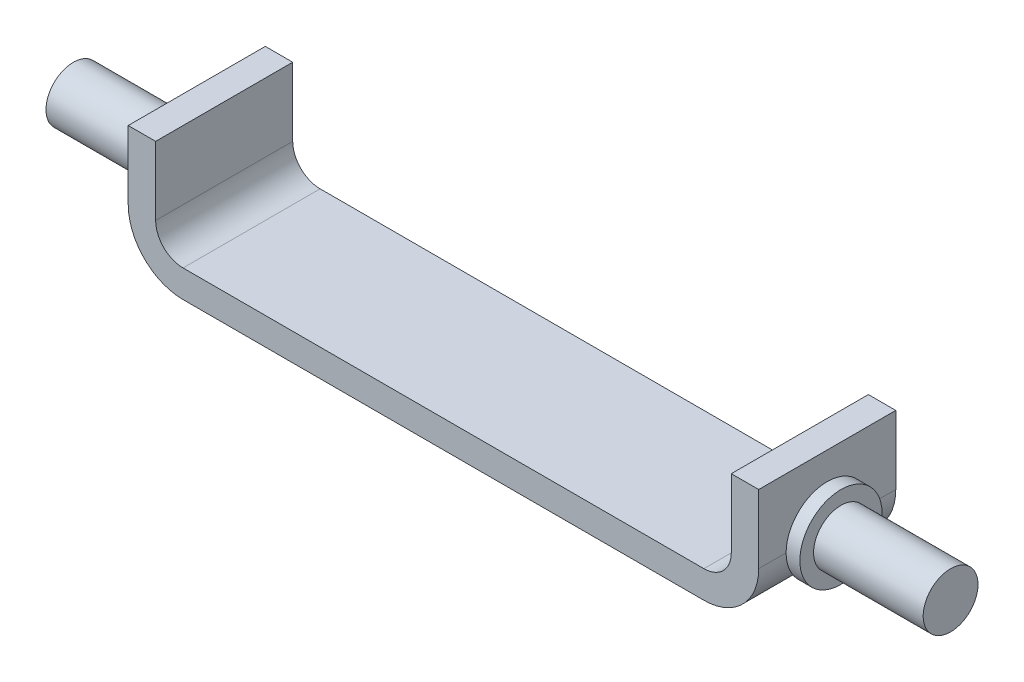
ISO-10303-21;
HEADER;
FILE_DESCRIPTION(('STEP AP214'),'2;1');
FILE_NAME('part.step','',(''),(''),'','','');
FILE_SCHEMA(('AUTOMOTIVE_DESIGN { 1 0 10303 214 1 1 1 1 }'));
ENDSEC;
DATA;
#1=APPLICATION_CONTEXT('core data for automotive mechanical design processes');
#2=APPLICATION_PROTOCOL_DEFINITION('international standard','automotive_design',2000,#1);
#3=PRODUCT_CONTEXT('',#1,'mechanical');
#4=PRODUCT('Part','Part','',(#3));
#5=PRODUCT_RELATED_PRODUCT_CATEGORY('part','',(#4));
#6=PRODUCT_DEFINITION_FORMATION('','',#4);
#7=PRODUCT_DEFINITION_CONTEXT('part definition',#1,'design');
#8=PRODUCT_DEFINITION('design','',#6,#7);
#9=PRODUCT_DEFINITION_SHAPE('','',#8);
#10=(LENGTH_UNIT() NAMED_UNIT(*) SI_UNIT(.MILLI.,.METRE.));
#11=(NAMED_UNIT(*) PLANE_ANGLE_UNIT() SI_UNIT($,.RADIAN.));
#12=(NAMED_UNIT(*) SI_UNIT($,.STERADIAN.) SOLID_ANGLE_UNIT());
#13=UNCERTAINTY_MEASURE_WITH_UNIT(LENGTH_MEASURE(1.E-05),#10,'distance_accuracy_value','');
#14=(GEOMETRIC_REPRESENTATION_CONTEXT(3) GLOBAL_UNCERTAINTY_ASSIGNED_CONTEXT((#13)) GLOBAL_UNIT_ASSIGNED_CONTEXT((#10,
#11,#12)) REPRESENTATION_CONTEXT('',''));
#15=CARTESIAN_POINT('',(0.,0.,0.));
#16=DIRECTION('',(0.,0.,1.));
#17=DIRECTION('',(1.,0.,0.));
#18=AXIS2_PLACEMENT_3D('',#15,#16,#17);
#19=CARTESIAN_POINT('',(113.582101442099,10.0000000000001,50.));
#20=DIRECTION('',(-1.,0.,0.));
#21=DIRECTION('',(0.,0.,1.));
#22=AXIS2_PLACEMENT_3D('',#19,#20,#21);
#23=PLANE('',#22);
#24=CARTESIAN_POINT('',(113.582101442099,10.,25.));
#25=DIRECTION('',(1.,0.,0.));
#26=DIRECTION('',(0.,0.,-1.));
#27=AXIS2_PLACEMENT_3D('',#24,#25,#26);
#28=CIRCLE('',#27,15.);
#29=CARTESIAN_POINT('',(113.582101442099,10.,10.));
#30=VERTEX_POINT('',#29);
#31=CARTESIAN_POINT('',(113.582101442099,10.,40.));
#32=VERTEX_POINT('',#31);
#33=EDGE_CURVE('E306',#30,#32,#28,.T.);
#34=ORIENTED_EDGE('',*,*,#33,.F.);
#35=DIRECTION('',(0.,0.,-1.));
#36=VECTOR('',#35,1.);
#37=CARTESIAN_POINT('',(113.582101442099,10.,50.));
#38=LINE('',#37,#36);
#39=CARTESIAN_POINT('',(113.582101442099,10.,0.));
#40=VERTEX_POINT('',#39);
#41=EDGE_CURVE('E205',#30,#40,#38,.T.);
#42=ORIENTED_EDGE('',*,*,#41,.T.);
#43=DIRECTION('',(0.,1.,0.));
#44=VECTOR('',#43,1.);
#45=CARTESIAN_POINT('',(113.582101442099,10.0000000000001,0.));
#46=LINE('',#45,#44);
#47=CARTESIAN_POINT('',(113.582101442099,35.,0.));
#48=VERTEX_POINT('',#47);
#49=EDGE_CURVE('E162',#40,#48,#46,.T.);
#50=ORIENTED_EDGE('',*,*,#49,.T.);
#51=DIRECTION('',(0.,0.,-1.));
#52=VECTOR('',#51,1.);
#53=CARTESIAN_POINT('',(113.582101442099,35.,50.));
#54=LINE('',#53,#52);
#55=CARTESIAN_POINT('',(113.582101442099,35.,50.));
#56=VERTEX_POINT('',#55);
#57=EDGE_CURVE('E11',#56,#48,#54,.T.);
#58=ORIENTED_EDGE('',*,*,#57,.F.);
#59=DIRECTION('',(0.,1.,0.));
#60=VECTOR('',#59,1.);
#61=CARTESIAN_POINT('',(113.582101442099,10.0000000000001,50.));
#62=LINE('',#61,#60);
#63=CARTESIAN_POINT('',(113.582101442099,10.,50.));
#64=VERTEX_POINT('',#63);
#65=EDGE_CURVE('E147',#64,#56,#62,.T.);
#66=ORIENTED_EDGE('',*,*,#65,.F.);
#67=EDGE_CURVE('E249',#64,#32,#38,.T.);
#68=ORIENTED_EDGE('',*,*,#67,.T.);
#69=EDGE_LOOP('',(#34,#42,#50,#58,#66,#68));
#70=FACE_BOUND('',#69,.T.);
#71=ADVANCED_FACE('F45',(#70),#23,.F.);
#72=CARTESIAN_POINT('',(103.582101442099,35.,50.));
#73=DIRECTION('',(0.,1.,0.));
#74=DIRECTION('',(0.,0.,1.));
#75=AXIS2_PLACEMENT_3D('',#72,#73,#74);
#76=PLANE('',#75);
#77=DIRECTION('',(1.,0.,0.));
#78=VECTOR('',#77,1.);
#79=CARTESIAN_POINT('',(103.582101442099,35.,0.));
#80=LINE('',#79,#78);
#81=CARTESIAN_POINT('',(103.582101442099,35.,0.));
#82=VERTEX_POINT('',#81);
#83=EDGE_CURVE('E208',#82,#48,#80,.T.);
#84=ORIENTED_EDGE('',*,*,#83,.F.);
#85=DIRECTION('',(0.,0.,-1.));
#86=VECTOR('',#85,1.);
#87=CARTESIAN_POINT('',(103.582101442099,35.,50.));
#88=LINE('',#87,#86);
#89=CARTESIAN_POINT('',(103.582101442099,35.,50.));
#90=VERTEX_POINT('',#89);
#91=EDGE_CURVE('E54',#90,#82,#88,.T.);
#92=ORIENTED_EDGE('',*,*,#91,.F.);
#93=DIRECTION('',(1.,0.,0.));
#94=VECTOR('',#93,1.);
#95=CARTESIAN_POINT('',(103.582101442099,35.,50.));
#96=LINE('',#95,#94);
#97=EDGE_CURVE('E152',#90,#56,#96,.T.);
#98=ORIENTED_EDGE('',*,*,#97,.T.);
#99=ORIENTED_EDGE('',*,*,#57,.T.);
#100=EDGE_LOOP('',(#84,#92,#98,#99));
#101=FACE_BOUND('',#100,.T.);
#102=ADVANCED_FACE('F166',(#101),#76,.T.);
#103=CARTESIAN_POINT('',(103.582101442099,10.0000000000001,50.));
#104=DIRECTION('',(-1.,0.,0.));
#105=DIRECTION('',(0.,0.,1.));
#106=AXIS2_PLACEMENT_3D('',#103,#104,#105);
#107=PLANE('',#106);
#108=DIRECTION('',(0.,1.,0.));
#109=VECTOR('',#108,1.);
#110=CARTESIAN_POINT('',(103.582101442099,10.0000000000001,0.));
#111=LINE('',#110,#109);
#112=CARTESIAN_POINT('',(103.582101442099,10.,0.));
#113=VERTEX_POINT('',#112);
#114=EDGE_CURVE('E212',#113,#82,#111,.T.);
#115=ORIENTED_EDGE('',*,*,#114,.F.);
#116=DIRECTION('',(0.,0.,-1.));
#117=VECTOR('',#116,1.);
#118=CARTESIAN_POINT('',(103.582101442099,10.,50.));
#119=LINE('',#118,#117);
#120=CARTESIAN_POINT('',(103.582101442099,10.,50.));
#121=VERTEX_POINT('',#120);
#122=EDGE_CURVE('E281',#121,#113,#119,.T.);
#123=ORIENTED_EDGE('',*,*,#122,.F.);
#124=DIRECTION('',(0.,1.,0.));
#125=VECTOR('',#124,1.);
#126=CARTESIAN_POINT('',(103.582101442099,10.0000000000001,50.));
#127=LINE('',#126,#125);
#128=EDGE_CURVE('E168',#121,#90,#127,.T.);
#129=ORIENTED_EDGE('',*,*,#128,.T.);
#130=ORIENTED_EDGE('',*,*,#91,.T.);
#131=EDGE_LOOP('',(#115,#123,#129,#130));
#132=FACE_BOUND('',#131,.T.);
#133=ADVANCED_FACE('F330',(#132),#107,.T.);
#134=CARTESIAN_POINT('',(93.5821014420986,10.,50.));
#135=DIRECTION('',(0.,0.,-1.));
#136=DIRECTION('',(-1.,0.,0.));
#137=AXIS2_PLACEMENT_3D('',#134,#135,#136);
#138=CYLINDRICAL_SURFACE('',#137,10.);
#139=CARTESIAN_POINT('',(93.5821014420986,10.,0.));
#140=DIRECTION('',(0.,0.,1.));
#141=DIRECTION('',(1.,0.,0.));
#142=AXIS2_PLACEMENT_3D('',#139,#140,#141);
#143=CIRCLE('',#142,10.);
#144=CARTESIAN_POINT('',(93.5821014420985,0.,0.));
#145=VERTEX_POINT('',#144);
#146=EDGE_CURVE('E216',#145,#113,#143,.T.);
#147=ORIENTED_EDGE('',*,*,#146,.F.);
#148=DIRECTION('',(0.,0.,-1.));
#149=VECTOR('',#148,1.);
#150=CARTESIAN_POINT('',(93.5821014420985,0.,50.));
#151=LINE('',#150,#149);
#152=CARTESIAN_POINT('',(93.5821014420985,0.,50.));
#153=VERTEX_POINT('',#152);
#154=EDGE_CURVE('E278',#153,#145,#151,.T.);
#155=ORIENTED_EDGE('',*,*,#154,.F.);
#156=CARTESIAN_POINT('',(93.5821014420986,10.,50.));
#157=DIRECTION('',(0.,0.,1.));
#158=DIRECTION('',(1.,0.,0.));
#159=AXIS2_PLACEMENT_3D('',#156,#157,#158);
#160=CIRCLE('',#159,10.);
#161=EDGE_CURVE('E171',#153,#121,#160,.T.);
#162=ORIENTED_EDGE('',*,*,#161,.T.);
#163=ORIENTED_EDGE('',*,*,#122,.T.);
#164=EDGE_LOOP('',(#147,#155,#162,#163));
#165=FACE_BOUND('',#164,.T.);
#166=ADVANCED_FACE('F334',(#165),#138,.F.);
#167=CARTESIAN_POINT('',(-96.4178985579013,0.,50.));
#168=DIRECTION('',(0.,1.,0.));
#169=DIRECTION('',(0.,0.,1.));
#170=AXIS2_PLACEMENT_3D('',#167,#168,#169);
#171=PLANE('',#170);
#172=DIRECTION('',(1.,0.,0.));
#173=VECTOR('',#172,1.);
#174=CARTESIAN_POINT('',(-96.4178985579013,0.,0.));
#175=LINE('',#174,#173);
#176=CARTESIAN_POINT('',(-96.4178985579013,0.,0.));
#177=VERTEX_POINT('',#176);
#178=EDGE_CURVE('E220',#177,#145,#175,.T.);
#179=ORIENTED_EDGE('',*,*,#178,.F.);
#180=DIRECTION('',(0.,0.,-1.));
#181=VECTOR('',#180,1.);
#182=CARTESIAN_POINT('',(-96.4178985579013,0.,50.));
#183=LINE('',#182,#181);
#184=CARTESIAN_POINT('',(-96.4178985579013,0.,50.));
#185=VERTEX_POINT('',#184);
#186=EDGE_CURVE('E275',#185,#177,#183,.T.);
#187=ORIENTED_EDGE('',*,*,#186,.F.);
#188=DIRECTION('',(1.,0.,0.));
#189=VECTOR('',#188,1.);
#190=CARTESIAN_POINT('',(-96.4178985579013,0.,50.));
#191=LINE('',#190,#189);
#192=EDGE_CURVE('E178',#185,#153,#191,.T.);
#193=ORIENTED_EDGE('',*,*,#192,.T.);
#194=ORIENTED_EDGE('',*,*,#154,.T.);
#195=EDGE_LOOP('',(#179,#187,#193,#194));
#196=FACE_BOUND('',#195,.T.);
#197=ADVANCED_FACE('F340',(#196),#171,.T.);
#198=CARTESIAN_POINT('',(-96.4178985579014,10.,50.));
#199=DIRECTION('',(0.,0.,-1.));
#200=DIRECTION('',(-1.,0.,0.));
#201=AXIS2_PLACEMENT_3D('',#198,#199,#200);
#202=CYLINDRICAL_SURFACE('',#201,10.);
#203=CARTESIAN_POINT('',(-96.4178985579014,10.,0.));
#204=DIRECTION('',(0.,0.,1.));
#205=DIRECTION('',(-1.,0.,0.));
#206=AXIS2_PLACEMENT_3D('',#203,#204,#205);
#207=CIRCLE('',#206,10.);
#208=CARTESIAN_POINT('',(-106.417898557901,10.0000000000001,0.));
#209=VERTEX_POINT('',#208);
#210=EDGE_CURVE('E224',#209,#177,#207,.T.);
#211=ORIENTED_EDGE('',*,*,#210,.F.);
#212=DIRECTION('',(0.,0.,-1.));
#213=VECTOR('',#212,1.);
#214=CARTESIAN_POINT('',(-106.417898557901,10.0000000000001,50.));
#215=LINE('',#214,#213);
#216=CARTESIAN_POINT('',(-106.417898557901,10.0000000000001,50.));
#217=VERTEX_POINT('',#216);
#218=EDGE_CURVE('E272',#217,#209,#215,.T.);
#219=ORIENTED_EDGE('',*,*,#218,.F.);
#220=CARTESIAN_POINT('',(-96.4178985579014,10.,50.));
#221=DIRECTION('',(0.,0.,1.));
#222=DIRECTION('',(-1.,0.,0.));
#223=AXIS2_PLACEMENT_3D('',#220,#221,#222);
#224=CIRCLE('',#223,10.);
#225=EDGE_CURVE('E182',#217,#185,#224,.T.);
#226=ORIENTED_EDGE('',*,*,#225,.T.);
#227=ORIENTED_EDGE('',*,*,#186,.T.);
#228=EDGE_LOOP('',(#211,#219,#226,#227));
#229=FACE_BOUND('',#228,.T.);
#230=ADVANCED_FACE('F344',(#229),#202,.F.);
#231=CARTESIAN_POINT('',(-106.417898557901,10.0000000000001,50.));
#232=DIRECTION('',(1.,0.,0.));
#233=DIRECTION('',(0.,0.,-1.));
#234=AXIS2_PLACEMENT_3D('',#231,#232,#233);
#235=PLANE('',#234);
#236=DIRECTION('',(0.,-1.,0.));
#237=VECTOR('',#236,1.);
#238=CARTESIAN_POINT('',(-106.417898557901,10.0000000000001,0.));
#239=LINE('',#238,#237);
#240=CARTESIAN_POINT('',(-106.417898557901,35.,0.));
#241=VERTEX_POINT('',#240);
#242=EDGE_CURVE('E228',#241,#209,#239,.T.);
#243=ORIENTED_EDGE('',*,*,#242,.F.);
#244=DIRECTION('',(0.,0.,-1.));
#245=VECTOR('',#244,1.);
#246=CARTESIAN_POINT('',(-106.417898557901,35.,50.));
#247=LINE('',#246,#245);
#248=CARTESIAN_POINT('',(-106.417898557901,35.,50.));
#249=VERTEX_POINT('',#248);
#250=EDGE_CURVE('E269',#249,#241,#247,.T.);
#251=ORIENTED_EDGE('',*,*,#250,.F.);
#252=DIRECTION('',(0.,-1.,0.));
#253=VECTOR('',#252,1.);
#254=CARTESIAN_POINT('',(-106.417898557901,10.0000000000001,50.));
#255=LINE('',#254,#253);
#256=EDGE_CURVE('E186',#249,#217,#255,.T.);
#257=ORIENTED_EDGE('',*,*,#256,.T.);
#258=ORIENTED_EDGE('',*,*,#218,.T.);
#259=EDGE_LOOP('',(#243,#251,#257,#258));
#260=FACE_BOUND('',#259,.T.);
#261=ADVANCED_FACE('F348',(#260),#235,.T.);
#262=CARTESIAN_POINT('',(-116.417898557901,35.,50.));
#263=DIRECTION('',(0.,1.,0.));
#264=DIRECTION('',(0.,0.,1.));
#265=AXIS2_PLACEMENT_3D('',#262,#263,#264);
#266=PLANE('',#265);
#267=DIRECTION('',(1.,0.,0.));
#268=VECTOR('',#267,1.);
#269=CARTESIAN_POINT('',(-116.417898557901,35.,0.));
#270=LINE('',#269,#268);
#271=CARTESIAN_POINT('',(-116.417898557901,35.,0.));
#272=VERTEX_POINT('',#271);
#273=EDGE_CURVE('E232',#272,#241,#270,.T.);
#274=ORIENTED_EDGE('',*,*,#273,.F.);
#275=DIRECTION('',(0.,0.,-1.));
#276=VECTOR('',#275,1.);
#277=CARTESIAN_POINT('',(-116.417898557901,35.,50.));
#278=LINE('',#277,#276);
#279=CARTESIAN_POINT('',(-116.417898557901,35.,50.));
#280=VERTEX_POINT('',#279);
#281=EDGE_CURVE('E265',#280,#272,#278,.T.);
#282=ORIENTED_EDGE('',*,*,#281,.F.);
#283=DIRECTION('',(1.,0.,0.));
#284=VECTOR('',#283,1.);
#285=CARTESIAN_POINT('',(-116.417898557901,35.,50.));
#286=LINE('',#285,#284);
#287=EDGE_CURVE('E190',#280,#249,#286,.T.);
#288=ORIENTED_EDGE('',*,*,#287,.T.);
#289=ORIENTED_EDGE('',*,*,#250,.T.);
#290=EDGE_LOOP('',(#274,#282,#288,#289));
#291=FACE_BOUND('',#290,.T.);
#292=ADVANCED_FACE('F352',(#291),#266,.T.);
#293=CARTESIAN_POINT('',(-116.417898557901,10.0000000000001,50.));
#294=DIRECTION('',(1.,0.,0.));
#295=DIRECTION('',(0.,0.,-1.));
#296=AXIS2_PLACEMENT_3D('',#293,#294,#295);
#297=PLANE('',#296);
#298=CARTESIAN_POINT('',(-116.417898557901,10.0000000000001,25.));
#299=DIRECTION('',(-1.,0.,0.));
#300=DIRECTION('',(0.,0.,1.));
#301=AXIS2_PLACEMENT_3D('',#298,#299,#300);
#302=CIRCLE('',#301,15.);
#303=CARTESIAN_POINT('',(-116.417898557901,10.0000000000001,40.));
#304=VERTEX_POINT('',#303);
#305=CARTESIAN_POINT('',(-116.417898557901,10.0000000000001,10.));
#306=VERTEX_POINT('',#305);
#307=EDGE_CURVE('E297',#304,#306,#302,.T.);
#308=ORIENTED_EDGE('',*,*,#307,.F.);
#309=DIRECTION('',(0.,0.,-1.));
#310=VECTOR('',#309,1.);
#311=CARTESIAN_POINT('',(-116.417898557901,10.0000000000001,50.));
#312=LINE('',#311,#310);
#313=CARTESIAN_POINT('',(-116.417898557901,10.0000000000001,50.));
#314=VERTEX_POINT('',#313);
#315=EDGE_CURVE('E261',#314,#304,#312,.T.);
#316=ORIENTED_EDGE('',*,*,#315,.F.);
#317=DIRECTION('',(0.,1.,0.));
#318=VECTOR('',#317,1.);
#319=CARTESIAN_POINT('',(-116.417898557901,10.0000000000001,50.));
#320=LINE('',#319,#318);
#321=EDGE_CURVE('E194',#280,#314,#320,.F.);
#322=ORIENTED_EDGE('',*,*,#321,.F.);
#323=ORIENTED_EDGE('',*,*,#281,.T.);
#324=DIRECTION('',(0.,1.,0.));
#325=VECTOR('',#324,1.);
#326=CARTESIAN_POINT('',(-116.417898557901,10.0000000000001,0.));
#327=LINE('',#326,#325);
#328=CARTESIAN_POINT('',(-116.417898557901,10.0000000000001,0.));
#329=VERTEX_POINT('',#328);
#330=EDGE_CURVE('E236',#272,#329,#327,.F.);
#331=ORIENTED_EDGE('',*,*,#330,.T.);
#332=EDGE_CURVE('E260',#306,#329,#312,.T.);
#333=ORIENTED_EDGE('',*,*,#332,.F.);
#334=EDGE_LOOP('',(#308,#316,#322,#323,#331,#333));
#335=FACE_BOUND('',#334,.T.);
#336=ADVANCED_FACE('F356',(#335),#297,.F.);
#337=CARTESIAN_POINT('',(-96.4178985579014,10.,50.));
#338=DIRECTION('',(0.,0.,-1.));
#339=DIRECTION('',(-1.,0.,0.));
#340=AXIS2_PLACEMENT_3D('',#337,#338,#339);
#341=CYLINDRICAL_SURFACE('',#340,20.);
#342=CARTESIAN_POINT('',(-96.4178985579014,10.,0.));
#343=DIRECTION('',(0.,0.,1.));
#344=DIRECTION('',(1.,0.,0.));
#345=AXIS2_PLACEMENT_3D('',#342,#343,#344);
#346=CIRCLE('',#345,20.);
#347=CARTESIAN_POINT('',(-96.4178985579013,-10.,0.));
#348=VERTEX_POINT('',#347);
#349=EDGE_CURVE('E240',#329,#348,#346,.T.);
#350=ORIENTED_EDGE('',*,*,#349,.T.);
#351=DIRECTION('',(0.,0.,-1.));
#352=VECTOR('',#351,1.);
#353=CARTESIAN_POINT('',(-96.4178985579013,-10.,50.));
#354=LINE('',#353,#352);
#355=CARTESIAN_POINT('',(-96.4178985579013,-10.,50.));
#356=VERTEX_POINT('',#355);
#357=EDGE_CURVE('E256',#356,#348,#354,.T.);
#358=ORIENTED_EDGE('',*,*,#357,.F.);
#359=CARTESIAN_POINT('',(-96.4178985579014,10.,50.));
#360=DIRECTION('',(0.,0.,1.));
#361=DIRECTION('',(1.,0.,0.));
#362=AXIS2_PLACEMENT_3D('',#359,#360,#361);
#363=CIRCLE('',#362,20.);
#364=EDGE_CURVE('E197',#314,#356,#363,.T.);
#365=ORIENTED_EDGE('',*,*,#364,.F.);
#366=ORIENTED_EDGE('',*,*,#315,.T.);
#367=EDGE_CURVE('E266',#304,#306,#312,.T.);
#368=ORIENTED_EDGE('',*,*,#367,.T.);
#369=ORIENTED_EDGE('',*,*,#332,.T.);
#370=EDGE_LOOP('',(#350,#358,#365,#366,#368,#369));
#371=FACE_BOUND('',#370,.T.);
#372=ADVANCED_FACE('F360',(#371),#341,.T.);
#373=CARTESIAN_POINT('',(-96.4178985579013,-10.,50.));
#374=DIRECTION('',(0.,1.,0.));
#375=DIRECTION('',(0.,0.,1.));
#376=AXIS2_PLACEMENT_3D('',#373,#374,#375);
#377=PLANE('',#376);
#378=DIRECTION('',(1.,0.,0.));
#379=VECTOR('',#378,1.);
#380=CARTESIAN_POINT('',(-96.4178985579013,-10.,0.));
#381=LINE('',#380,#379);
#382=CARTESIAN_POINT('',(93.5821014420984,-10.,0.));
#383=VERTEX_POINT('',#382);
#384=EDGE_CURVE('E243',#348,#383,#381,.T.);
#385=ORIENTED_EDGE('',*,*,#384,.T.);
#386=DIRECTION('',(0.,0.,-1.));
#387=VECTOR('',#386,1.);
#388=CARTESIAN_POINT('',(93.5821014420984,-10.,50.));
#389=LINE('',#388,#387);
#390=CARTESIAN_POINT('',(93.5821014420984,-10.,50.));
#391=VERTEX_POINT('',#390);
#392=EDGE_CURVE('E252',#391,#383,#389,.T.);
#393=ORIENTED_EDGE('',*,*,#392,.F.);
#394=DIRECTION('',(1.,0.,0.));
#395=VECTOR('',#394,1.);
#396=CARTESIAN_POINT('',(-96.4178985579013,-10.,50.));
#397=LINE('',#396,#395);
#398=EDGE_CURVE('E200',#356,#391,#397,.T.);
#399=ORIENTED_EDGE('',*,*,#398,.F.);
#400=ORIENTED_EDGE('',*,*,#357,.T.);
#401=EDGE_LOOP('',(#385,#393,#399,#400));
#402=FACE_BOUND('',#401,.T.);
#403=ADVANCED_FACE('F364',(#402),#377,.F.);
#404=CARTESIAN_POINT('',(93.5821014420986,10.,50.));
#405=DIRECTION('',(0.,0.,-1.));
#406=DIRECTION('',(-1.,0.,0.));
#407=AXIS2_PLACEMENT_3D('',#404,#405,#406);
#408=CYLINDRICAL_SURFACE('',#407,20.);
#409=CARTESIAN_POINT('',(93.5821014420986,10.,0.));
#410=DIRECTION('',(0.,0.,1.));
#411=DIRECTION('',(1.,0.,0.));
#412=AXIS2_PLACEMENT_3D('',#409,#410,#411);
#413=CIRCLE('',#412,20.);
#414=EDGE_CURVE('E158',#383,#40,#413,.T.);
#415=ORIENTED_EDGE('',*,*,#414,.T.);
#416=ORIENTED_EDGE('',*,*,#41,.F.);
#417=EDGE_CURVE('E62',#32,#30,#38,.T.);
#418=ORIENTED_EDGE('',*,*,#417,.F.);
#419=ORIENTED_EDGE('',*,*,#67,.F.);
#420=CARTESIAN_POINT('',(93.5821014420986,10.,50.));
#421=DIRECTION('',(0.,0.,1.));
#422=DIRECTION('',(1.,0.,0.));
#423=AXIS2_PLACEMENT_3D('',#420,#421,#422);
#424=CIRCLE('',#423,20.);
#425=EDGE_CURVE('E155',#391,#64,#424,.T.);
#426=ORIENTED_EDGE('',*,*,#425,.F.);
#427=ORIENTED_EDGE('',*,*,#392,.T.);
#428=EDGE_LOOP('',(#415,#416,#418,#419,#426,#427));
#429=FACE_BOUND('',#428,.T.);
#430=ADVANCED_FACE('F368',(#429),#408,.T.);
#431=CARTESIAN_POINT('',(93.5821014420986,10.,50.));
#432=DIRECTION('',(0.,0.,1.));
#433=DIRECTION('',(1.,0.,0.));
#434=AXIS2_PLACEMENT_3D('',#431,#432,#433);
#435=PLANE('',#434);
#436=ORIENTED_EDGE('',*,*,#65,.T.);
#437=ORIENTED_EDGE('',*,*,#97,.F.);
#438=ORIENTED_EDGE('',*,*,#128,.F.);
#439=ORIENTED_EDGE('',*,*,#161,.F.);
#440=ORIENTED_EDGE('',*,*,#192,.F.);
#441=ORIENTED_EDGE('',*,*,#225,.F.);
#442=ORIENTED_EDGE('',*,*,#256,.F.);
#443=ORIENTED_EDGE('',*,*,#287,.F.);
#444=ORIENTED_EDGE('',*,*,#321,.T.);
#445=ORIENTED_EDGE('',*,*,#364,.T.);
#446=ORIENTED_EDGE('',*,*,#398,.T.);
#447=ORIENTED_EDGE('',*,*,#425,.T.);
#448=EDGE_LOOP('',(#436,#437,#438,#439,#440,#441,#442,#443,#444,#445,#446,#447));
#449=FACE_BOUND('',#448,.T.);
#450=ADVANCED_FACE('F149',(#449),#435,.T.);
#451=CARTESIAN_POINT('',(93.5821014420986,10.,0.));
#452=DIRECTION('',(0.,0.,1.));
#453=DIRECTION('',(1.,0.,0.));
#454=AXIS2_PLACEMENT_3D('',#451,#452,#453);
#455=PLANE('',#454);
#456=ORIENTED_EDGE('',*,*,#49,.F.);
#457=ORIENTED_EDGE('',*,*,#414,.F.);
#458=ORIENTED_EDGE('',*,*,#384,.F.);
#459=ORIENTED_EDGE('',*,*,#349,.F.);
#460=ORIENTED_EDGE('',*,*,#330,.F.);
#461=ORIENTED_EDGE('',*,*,#273,.T.);
#462=ORIENTED_EDGE('',*,*,#242,.T.);
#463=ORIENTED_EDGE('',*,*,#210,.T.);
#464=ORIENTED_EDGE('',*,*,#178,.T.);
#465=ORIENTED_EDGE('',*,*,#146,.T.);
#466=ORIENTED_EDGE('',*,*,#114,.T.);
#467=ORIENTED_EDGE('',*,*,#83,.T.);
#468=EDGE_LOOP('',(#456,#457,#458,#459,#460,#461,#462,#463,#464,#465,#466,#467));
#469=FACE_BOUND('',#468,.T.);
#470=ADVANCED_FACE('F372',(#469),#455,.F.);
#471=CARTESIAN_POINT('',(113.582101442099,10.,25.));
#472=DIRECTION('',(1.,0.,0.));
#473=DIRECTION('',(0.,0.,-1.));
#474=AXIS2_PLACEMENT_3D('',#471,#472,#473);
#475=PLANE('',#474);
#476=ORIENTED_EDGE('',*,*,#417,.T.);
#477=EDGE_CURVE('E605',#32,#30,#28,.T.);
#478=ORIENTED_EDGE('',*,*,#477,.F.);
#479=EDGE_LOOP('',(#476,#478));
#480=FACE_BOUND('',#479,.T.);
#481=ADVANCED_FACE('F374',(#480),#475,.F.);
#482=CARTESIAN_POINT('',(-116.417898557901,10.0000000000001,25.));
#483=DIRECTION('',(-1.,0.,0.));
#484=DIRECTION('',(0.,0.,1.));
#485=AXIS2_PLACEMENT_3D('',#482,#483,#484);
#486=PLANE('',#485);
#487=ORIENTED_EDGE('',*,*,#367,.F.);
#488=EDGE_CURVE('E303',#306,#304,#302,.T.);
#489=ORIENTED_EDGE('',*,*,#488,.F.);
#490=EDGE_LOOP('',(#487,#489));
#491=FACE_BOUND('',#490,.T.);
#492=ADVANCED_FACE('F393',(#491),#486,.F.);
#493=CARTESIAN_POINT('',(-121.417898557901,10.0000000000001,25.));
#494=DIRECTION('',(1.,0.,0.));
#495=DIRECTION('',(0.,0.,-1.));
#496=AXIS2_PLACEMENT_3D('',#493,#494,#495);
#497=CYLINDRICAL_SURFACE('',#496,15.);
#498=CARTESIAN_POINT('',(-121.417898557901,10.0000000000001,25.));
#499=DIRECTION('',(-1.,0.,0.));
#500=DIRECTION('',(0.,0.,1.));
#501=AXIS2_PLACEMENT_3D('',#498,#499,#500);
#502=CIRCLE('',#501,15.);
#503=CARTESIAN_POINT('',(-121.417898557901,10.0000000000001,40.));
#504=VERTEX_POINT('',#503);
#505=EDGE_CURVE('E289',#504,#504,#502,.T.);
#506=ORIENTED_EDGE('',*,*,#505,.F.);
#507=EDGE_LOOP('',(#506));
#508=FACE_BOUND('',#507,.T.);
#509=ORIENTED_EDGE('',*,*,#307,.T.);
#510=ORIENTED_EDGE('',*,*,#488,.T.);
#511=EDGE_LOOP('',(#509,#510));
#512=FACE_BOUND('',#511,.T.);
#513=ADVANCED_FACE('F400',(#508,#512),#497,.T.);
#514=CARTESIAN_POINT('',(-121.417898557901,10.0000000000001,25.));
#515=DIRECTION('',(-1.,0.,0.));
#516=DIRECTION('',(0.,0.,1.));
#517=AXIS2_PLACEMENT_3D('',#514,#515,#516);
#518=PLANE('',#517);
#519=CARTESIAN_POINT('',(-121.417898557901,10.0000000000001,25.));
#520=DIRECTION('',(-1.,0.,0.));
#521=DIRECTION('',(0.,0.,1.));
#522=AXIS2_PLACEMENT_3D('',#519,#520,#521);
#523=CIRCLE('',#522,10.);
#524=CARTESIAN_POINT('',(-121.417898557901,10.0000000000001,35.));
#525=VERTEX_POINT('',#524);
#526=EDGE_CURVE('E285',#525,#525,#523,.T.);
#527=ORIENTED_EDGE('',*,*,#526,.F.);
#528=EDGE_LOOP('',(#527));
#529=FACE_BOUND('',#528,.T.);
#530=ORIENTED_EDGE('',*,*,#505,.T.);
#531=EDGE_LOOP('',(#530));
#532=FACE_BOUND('',#531,.T.);
#533=ADVANCED_FACE('F409',(#529,#532),#518,.T.);
#534=CARTESIAN_POINT('',(-161.417898557901,10.0000000000001,25.));
#535=DIRECTION('',(-1.,0.,0.));
#536=DIRECTION('',(0.,0.,1.));
#537=AXIS2_PLACEMENT_3D('',#534,#535,#536);
#538=PLANE('',#537);
#539=CARTESIAN_POINT('',(-161.417898557901,10.0000000000001,25.));
#540=DIRECTION('',(-1.,0.,0.));
#541=DIRECTION('',(0.,0.,1.));
#542=AXIS2_PLACEMENT_3D('',#539,#540,#541);
#543=CIRCLE('',#542,10.);
#544=CARTESIAN_POINT('',(-161.417898557901,10.0000000000001,35.));
#545=VERTEX_POINT('',#544);
#546=EDGE_CURVE('E288',#545,#545,#543,.T.);
#547=ORIENTED_EDGE('',*,*,#546,.T.);
#548=EDGE_LOOP('',(#547));
#549=FACE_BOUND('',#548,.T.);
#550=ADVANCED_FACE('F417',(#549),#538,.T.);
#551=CARTESIAN_POINT('',(-161.417898557901,10.0000000000001,25.));
#552=DIRECTION('',(1.,0.,0.));
#553=DIRECTION('',(0.,0.,-1.));
#554=AXIS2_PLACEMENT_3D('',#551,#552,#553);
#555=CYLINDRICAL_SURFACE('',#554,10.);
#556=ORIENTED_EDGE('',*,*,#526,.T.);
#557=EDGE_LOOP('',(#556));
#558=FACE_BOUND('',#557,.T.);
#559=ORIENTED_EDGE('',*,*,#546,.F.);
#560=EDGE_LOOP('',(#559));
#561=FACE_BOUND('',#560,.T.);
#562=ADVANCED_FACE('F426',(#558,#561),#555,.T.);
#563=CARTESIAN_POINT('',(118.582101442099,10.,25.));
#564=DIRECTION('',(-1.,0.,0.));
#565=DIRECTION('',(0.,0.,1.));
#566=AXIS2_PLACEMENT_3D('',#563,#564,#565);
#567=CYLINDRICAL_SURFACE('',#566,15.);
#568=CARTESIAN_POINT('',(118.582101442099,10.,25.));
#569=DIRECTION('',(1.,0.,0.));
#570=DIRECTION('',(0.,0.,-1.));
#571=AXIS2_PLACEMENT_3D('',#568,#569,#570);
#572=CIRCLE('',#571,15.);
#573=CARTESIAN_POINT('',(118.582101442099,10.,10.));
#574=VERTEX_POINT('',#573);
#575=EDGE_CURVE('E600',#574,#574,#572,.T.);
#576=ORIENTED_EDGE('',*,*,#575,.F.);
#577=EDGE_LOOP('',(#576));
#578=FACE_BOUND('',#577,.T.);
#579=ORIENTED_EDGE('',*,*,#33,.T.);
#580=ORIENTED_EDGE('',*,*,#477,.T.);
#581=EDGE_LOOP('',(#579,#580));
#582=FACE_BOUND('',#581,.T.);
#583=ADVANCED_FACE('F434',(#578,#582),#567,.T.);
#584=CARTESIAN_POINT('',(118.582101442099,10.,25.));
#585=DIRECTION('',(1.,0.,0.));
#586=DIRECTION('',(0.,0.,-1.));
#587=AXIS2_PLACEMENT_3D('',#584,#585,#586);
#588=PLANE('',#587);
#589=CARTESIAN_POINT('',(118.582101442099,10.,25.));
#590=DIRECTION('',(1.,0.,0.));
#591=DIRECTION('',(0.,0.,-1.));
#592=AXIS2_PLACEMENT_3D('',#589,#590,#591);
#593=CIRCLE('',#592,10.);
#594=CARTESIAN_POINT('',(118.582101442099,10.,15.));
#595=VERTEX_POINT('',#594);
#596=EDGE_CURVE('E48',#595,#595,#593,.T.);
#597=ORIENTED_EDGE('',*,*,#596,.F.);
#598=EDGE_LOOP('',(#597));
#599=FACE_BOUND('',#598,.T.);
#600=ORIENTED_EDGE('',*,*,#575,.T.);
#601=EDGE_LOOP('',(#600));
#602=FACE_BOUND('',#601,.T.);
#603=ADVANCED_FACE('F321',(#599,#602),#588,.T.);
#604=CARTESIAN_POINT('',(158.582101442099,10.,25.));
#605=DIRECTION('',(1.,0.,0.));
#606=DIRECTION('',(0.,0.,-1.));
#607=AXIS2_PLACEMENT_3D('',#604,#605,#606);
#608=PLANE('',#607);
#609=CARTESIAN_POINT('',(158.582101442099,10.,25.));
#610=DIRECTION('',(1.,0.,0.));
#611=DIRECTION('',(0.,0.,-1.));
#612=AXIS2_PLACEMENT_3D('',#609,#610,#611);
#613=CIRCLE('',#612,10.);
#614=CARTESIAN_POINT('',(158.582101442099,10.,15.));
#615=VERTEX_POINT('',#614);
#616=EDGE_CURVE('E209',#615,#615,#613,.T.);
#617=ORIENTED_EDGE('',*,*,#616,.T.);
#618=EDGE_LOOP('',(#617));
#619=FACE_BOUND('',#618,.T.);
#620=ADVANCED_FACE('F312',(#619),#608,.T.);
#621=CARTESIAN_POINT('',(158.582101442099,10.,25.));
#622=DIRECTION('',(-1.,0.,0.));
#623=DIRECTION('',(0.,0.,1.));
#624=AXIS2_PLACEMENT_3D('',#621,#622,#623);
#625=CYLINDRICAL_SURFACE('',#624,10.);
#626=ORIENTED_EDGE('',*,*,#596,.T.);
#627=EDGE_LOOP('',(#626));
#628=FACE_BOUND('',#627,.T.);
#629=ORIENTED_EDGE('',*,*,#616,.F.);
#630=EDGE_LOOP('',(#629));
#631=FACE_BOUND('',#630,.T.);
#632=ADVANCED_FACE('F314',(#628,#631),#625,.T.);
#633=CLOSED_SHELL('',(#71,#102,#133,#166,#197,#230,#261,#292,#336,#372,#403,#430,#450,#470,#481,
#492,#513,#533,#550,#562,#583,#603,#620,#632));
#634=MANIFOLD_SOLID_BREP('B2',#633);
#635=ADVANCED_BREP_SHAPE_REPRESENTATION('',(#18,#634),#14);
#636=SHAPE_DEFINITION_REPRESENTATION(#9,#635);
ENDSEC;
END-ISO-10303-21;
